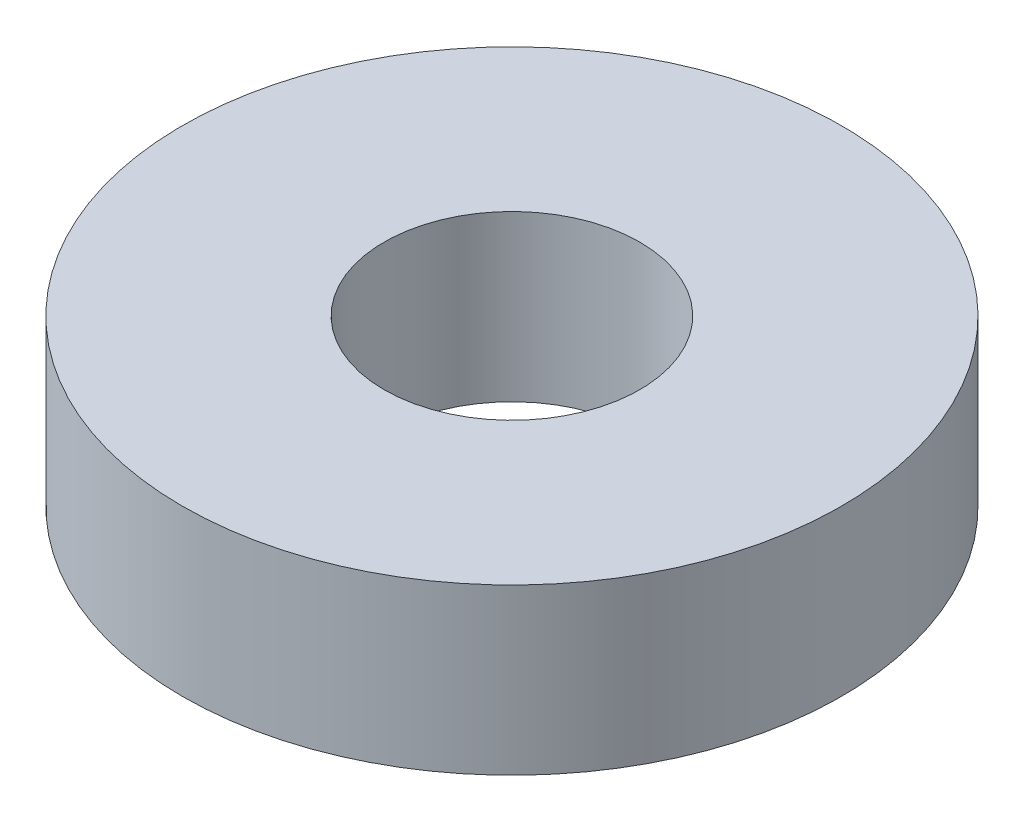
ISO-10303-21;
HEADER;
FILE_DESCRIPTION(('STEP AP214'),'2;1');
FILE_NAME('part.step','',(''),(''),'','','');
FILE_SCHEMA(('AUTOMOTIVE_DESIGN { 1 0 10303 214 1 1 1 1 }'));
ENDSEC;
DATA;
#1=APPLICATION_CONTEXT('core data for automotive mechanical design processes');
#2=APPLICATION_PROTOCOL_DEFINITION('international standard','automotive_design',2000,#1);
#3=PRODUCT_CONTEXT('',#1,'mechanical');
#4=PRODUCT('Part','Part','',(#3));
#5=PRODUCT_RELATED_PRODUCT_CATEGORY('part','',(#4));
#6=PRODUCT_DEFINITION_FORMATION('','',#4);
#7=PRODUCT_DEFINITION_CONTEXT('part definition',#1,'design');
#8=PRODUCT_DEFINITION('design','',#6,#7);
#9=PRODUCT_DEFINITION_SHAPE('','',#8);
#10=(LENGTH_UNIT() NAMED_UNIT(*) SI_UNIT(.MILLI.,.METRE.));
#11=(NAMED_UNIT(*) PLANE_ANGLE_UNIT() SI_UNIT($,.RADIAN.));
#12=(NAMED_UNIT(*) SI_UNIT($,.STERADIAN.) SOLID_ANGLE_UNIT());
#13=UNCERTAINTY_MEASURE_WITH_UNIT(LENGTH_MEASURE(1.E-05),#10,'distance_accuracy_value','');
#14=(GEOMETRIC_REPRESENTATION_CONTEXT(3) GLOBAL_UNCERTAINTY_ASSIGNED_CONTEXT((#13)) GLOBAL_UNIT_ASSIGNED_CONTEXT((#10,
#11,#12)) REPRESENTATION_CONTEXT('',''));
#15=CARTESIAN_POINT('',(0.,0.,0.));
#16=DIRECTION('',(0.,0.,1.));
#17=DIRECTION('',(1.,0.,0.));
#18=AXIS2_PLACEMENT_3D('',#15,#16,#17);
#19=CARTESIAN_POINT('',(0.,-1.5875,0.));
#20=DIRECTION('',(0.,1.,0.));
#21=DIRECTION('',(0.,0.,-1.));
#22=AXIS2_PLACEMENT_3D('',#19,#20,#21);
#23=PLANE('',#22);
#24=CARTESIAN_POINT('',(0.,-1.5875,0.));
#25=DIRECTION('',(0.,1.,0.));
#26=DIRECTION('',(0.,0.,1.));
#27=AXIS2_PLACEMENT_3D('',#24,#25,#26);
#28=CIRCLE('',#27,2.4638);
#29=CARTESIAN_POINT('',(0.,-1.5875,2.4638));
#30=VERTEX_POINT('',#29);
#31=EDGE_CURVE('E44',#30,#30,#28,.F.);
#32=ORIENTED_EDGE('',*,*,#31,.F.);
#33=EDGE_LOOP('',(#32));
#34=FACE_BOUND('',#33,.T.);
#35=CARTESIAN_POINT('',(0.,-1.5875,0.));
#36=DIRECTION('',(0.,1.,0.));
#37=DIRECTION('',(0.,0.,1.));
#38=AXIS2_PLACEMENT_3D('',#35,#36,#37);
#39=CIRCLE('',#38,6.35);
#40=CARTESIAN_POINT('',(0.,-1.5875,6.35));
#41=VERTEX_POINT('',#40);
#42=EDGE_CURVE('E35',#41,#41,#39,.F.);
#43=ORIENTED_EDGE('',*,*,#42,.T.);
#44=EDGE_LOOP('',(#43));
#45=FACE_BOUND('',#44,.T.);
#46=ADVANCED_FACE('F32',(#34,#45),#23,.F.);
#47=CARTESIAN_POINT('',(0.,1.5875,0.));
#48=DIRECTION('',(0.,-1.,0.));
#49=DIRECTION('',(0.,0.,1.));
#50=AXIS2_PLACEMENT_3D('',#47,#48,#49);
#51=CYLINDRICAL_SURFACE('',#50,6.35);
#52=ORIENTED_EDGE('',*,*,#42,.F.);
#53=EDGE_LOOP('',(#52));
#54=FACE_BOUND('',#53,.T.);
#55=CARTESIAN_POINT('',(0.,1.5875,0.));
#56=DIRECTION('',(0.,1.,0.));
#57=DIRECTION('',(0.,0.,1.));
#58=AXIS2_PLACEMENT_3D('',#55,#56,#57);
#59=CIRCLE('',#58,6.35);
#60=CARTESIAN_POINT('',(0.,1.5875,6.35));
#61=VERTEX_POINT('',#60);
#62=EDGE_CURVE('E39',#61,#61,#59,.F.);
#63=ORIENTED_EDGE('',*,*,#62,.T.);
#64=EDGE_LOOP('',(#63));
#65=FACE_BOUND('',#64,.T.);
#66=ADVANCED_FACE('F53',(#54,#65),#51,.T.);
#67=CARTESIAN_POINT('',(0.,1.5875,0.));
#68=DIRECTION('',(0.,-1.,0.));
#69=DIRECTION('',(0.,0.,1.));
#70=AXIS2_PLACEMENT_3D('',#67,#68,#69);
#71=CYLINDRICAL_SURFACE('',#70,2.4638);
#72=CARTESIAN_POINT('',(0.,1.5875,0.));
#73=DIRECTION('',(0.,1.,0.));
#74=DIRECTION('',(0.,0.,1.));
#75=AXIS2_PLACEMENT_3D('',#72,#73,#74);
#76=CIRCLE('',#75,2.4638);
#77=CARTESIAN_POINT('',(0.,1.5875,2.4638));
#78=VERTEX_POINT('',#77);
#79=EDGE_CURVE('E10',#78,#78,#76,.T.);
#80=ORIENTED_EDGE('',*,*,#79,.T.);
#81=EDGE_LOOP('',(#80));
#82=FACE_BOUND('',#81,.T.);
#83=ORIENTED_EDGE('',*,*,#31,.T.);
#84=EDGE_LOOP('',(#83));
#85=FACE_BOUND('',#84,.T.);
#86=ADVANCED_FACE('F56',(#82,#85),#71,.F.);
#87=CARTESIAN_POINT('',(0.,1.5875,0.));
#88=DIRECTION('',(0.,1.,0.));
#89=DIRECTION('',(0.,0.,-1.));
#90=AXIS2_PLACEMENT_3D('',#87,#88,#89);
#91=PLANE('',#90);
#92=ORIENTED_EDGE('',*,*,#79,.F.);
#93=EDGE_LOOP('',(#92));
#94=FACE_BOUND('',#93,.T.);
#95=ORIENTED_EDGE('',*,*,#62,.F.);
#96=EDGE_LOOP('',(#95));
#97=FACE_BOUND('',#96,.T.);
#98=ADVANCED_FACE('F59',(#94,#97),#91,.T.);
#99=CLOSED_SHELL('',(#46,#66,#86,#98));
#100=MANIFOLD_SOLID_BREP('B2',#99);
#101=ADVANCED_BREP_SHAPE_REPRESENTATION('',(#18,#100),#14);
#102=SHAPE_DEFINITION_REPRESENTATION(#9,#101);
ENDSEC;
END-ISO-10303-21;
